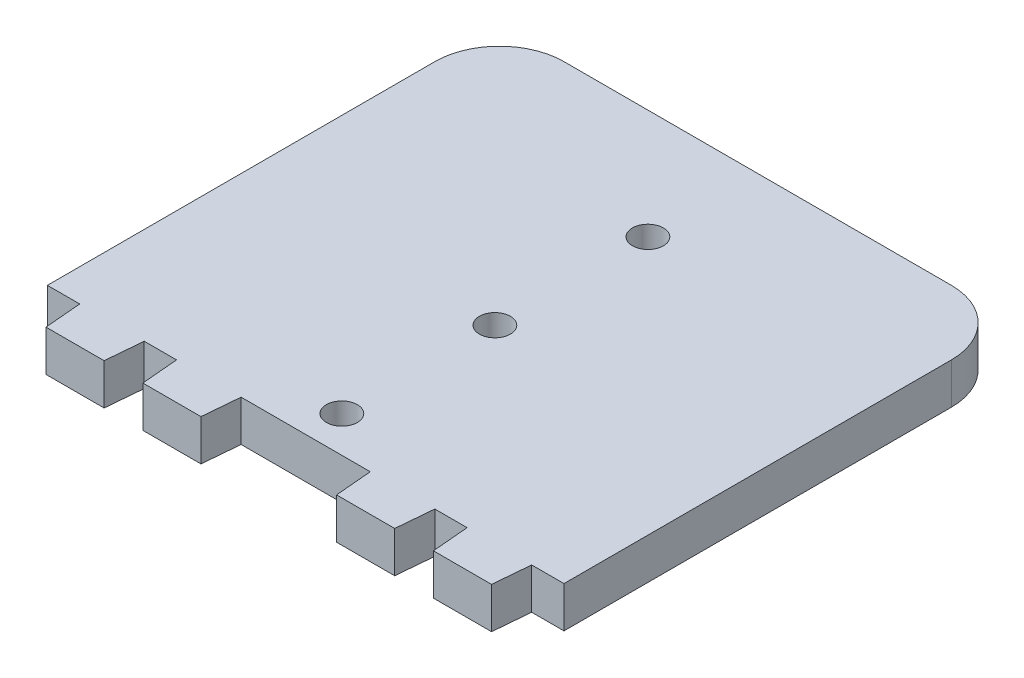
ISO-10303-21;
HEADER;
FILE_DESCRIPTION(('STEP AP214'),'2;1');
FILE_NAME('part.step','',(''),(''),'','','');
FILE_SCHEMA(('AUTOMOTIVE_DESIGN { 1 0 10303 214 1 1 1 1 }'));
ENDSEC;
DATA;
#1=APPLICATION_CONTEXT('core data for automotive mechanical design processes');
#2=APPLICATION_PROTOCOL_DEFINITION('international standard','automotive_design',2000,#1);
#3=PRODUCT_CONTEXT('',#1,'mechanical');
#4=PRODUCT('Part','Part','',(#3));
#5=PRODUCT_RELATED_PRODUCT_CATEGORY('part','',(#4));
#6=PRODUCT_DEFINITION_FORMATION('','',#4);
#7=PRODUCT_DEFINITION_CONTEXT('part definition',#1,'design');
#8=PRODUCT_DEFINITION('design','',#6,#7);
#9=PRODUCT_DEFINITION_SHAPE('','',#8);
#10=(LENGTH_UNIT() NAMED_UNIT(*) SI_UNIT(.MILLI.,.METRE.));
#11=(NAMED_UNIT(*) PLANE_ANGLE_UNIT() SI_UNIT($,.RADIAN.));
#12=(NAMED_UNIT(*) SI_UNIT($,.STERADIAN.) SOLID_ANGLE_UNIT());
#13=UNCERTAINTY_MEASURE_WITH_UNIT(LENGTH_MEASURE(1.E-05),#10,'distance_accuracy_value','');
#14=(GEOMETRIC_REPRESENTATION_CONTEXT(3) GLOBAL_UNCERTAINTY_ASSIGNED_CONTEXT((#13)) GLOBAL_UNIT_ASSIGNED_CONTEXT((#10,
#11,#12)) REPRESENTATION_CONTEXT('',''));
#15=CARTESIAN_POINT('',(0.,0.,0.));
#16=DIRECTION('',(0.,0.,1.));
#17=DIRECTION('',(1.,0.,0.));
#18=AXIS2_PLACEMENT_3D('',#15,#16,#17);
#19=CARTESIAN_POINT('',(22.8869329537262,6.35,2.00235633890864));
#20=DIRECTION('',(0.996194663464687,0.,0.0871561385358413));
#21=DIRECTION('',(0.0871561385358413,0.,-0.996194663464687));
#22=AXIS2_PLACEMENT_3D('',#19,#20,#21);
#23=PLANE('',#22);
#24=DIRECTION('',(-0.0871561385358414,0.,0.996194663464687));
#25=VECTOR('',#24,1.);
#26=CARTESIAN_POINT('',(22.8869329537262,0.,2.00235633890864));
#27=LINE('',#26,#25);
#28=CARTESIAN_POINT('',(20.,0.,35.));
#29=VERTEX_POINT('',#28);
#30=CARTESIAN_POINT('',(19.5,0.,40.715));
#31=VERTEX_POINT('',#30);
#32=EDGE_CURVE('E190',#29,#31,#27,.T.);
#33=ORIENTED_EDGE('',*,*,#32,.F.);
#34=DIRECTION('',(0.,-1.,0.));
#35=VECTOR('',#34,1.);
#36=CARTESIAN_POINT('',(20.,6.35,35.));
#37=LINE('',#36,#35);
#38=CARTESIAN_POINT('',(20.,6.35,35.));
#39=VERTEX_POINT('',#38);
#40=EDGE_CURVE('E184',#39,#29,#37,.T.);
#41=ORIENTED_EDGE('',*,*,#40,.F.);
#42=DIRECTION('',(-0.0871561385358414,0.,0.996194663464687));
#43=VECTOR('',#42,1.);
#44=CARTESIAN_POINT('',(22.8869329537262,6.35,2.00235633890864));
#45=LINE('',#44,#43);
#46=CARTESIAN_POINT('',(19.5,6.35,40.715));
#47=VERTEX_POINT('',#46);
#48=EDGE_CURVE('E187',#39,#47,#45,.T.);
#49=ORIENTED_EDGE('',*,*,#48,.T.);
#50=DIRECTION('',(0.,-1.,0.));
#51=VECTOR('',#50,1.);
#52=CARTESIAN_POINT('',(19.5,6.35,40.715));
#53=LINE('',#52,#51);
#54=EDGE_CURVE('E256',#47,#31,#53,.T.);
#55=ORIENTED_EDGE('',*,*,#54,.T.);
#56=EDGE_LOOP('',(#33,#41,#49,#55));
#57=FACE_BOUND('',#56,.T.);
#58=ADVANCED_FACE('F35',(#57),#23,.T.);
#59=CARTESIAN_POINT('',(0.,6.35,35.));
#60=DIRECTION('',(0.,0.,-1.));
#61=DIRECTION('',(-1.,0.,0.));
#62=AXIS2_PLACEMENT_3D('',#59,#60,#61);
#63=PLANE('',#62);
#64=DIRECTION('',(1.,0.,0.));
#65=VECTOR('',#64,1.);
#66=CARTESIAN_POINT('',(0.,0.,35.));
#67=LINE('',#66,#65);
#68=CARTESIAN_POINT('',(25.,0.,35.));
#69=VERTEX_POINT('',#68);
#70=EDGE_CURVE('E258',#29,#69,#67,.T.);
#71=ORIENTED_EDGE('',*,*,#70,.T.);
#72=DIRECTION('',(0.,-1.,0.));
#73=VECTOR('',#72,1.);
#74=CARTESIAN_POINT('',(25.,6.35,35.));
#75=LINE('',#74,#73);
#76=CARTESIAN_POINT('',(25.,6.35,35.));
#77=VERTEX_POINT('',#76);
#78=EDGE_CURVE('E194',#77,#69,#75,.T.);
#79=ORIENTED_EDGE('',*,*,#78,.F.);
#80=DIRECTION('',(1.,0.,0.));
#81=VECTOR('',#80,1.);
#82=CARTESIAN_POINT('',(0.,6.35,35.));
#83=LINE('',#82,#81);
#84=EDGE_CURVE('E197',#39,#77,#83,.T.);
#85=ORIENTED_EDGE('',*,*,#84,.F.);
#86=ORIENTED_EDGE('',*,*,#40,.T.);
#87=EDGE_LOOP('',(#71,#79,#85,#86));
#88=FACE_BOUND('',#87,.T.);
#89=ADVANCED_FACE('F198',(#88),#63,.F.);
#90=CARTESIAN_POINT('',(21.7712383844723,6.35,-1.90474526548309));
#91=DIRECTION('',(0.996194663464687,0.,-0.0871561385358411));
#92=DIRECTION('',(-0.0871561385358411,0.,-0.996194663464687));
#93=AXIS2_PLACEMENT_3D('',#90,#91,#92);
#94=PLANE('',#93);
#95=DIRECTION('',(0.0871561385358412,0.,0.996194663464687));
#96=VECTOR('',#95,1.);
#97=CARTESIAN_POINT('',(21.7712383844723,0.,-1.90474526548309));
#98=LINE('',#97,#96);
#99=CARTESIAN_POINT('',(25.5,0.,40.715));
#100=VERTEX_POINT('',#99);
#101=EDGE_CURVE('E260',#69,#100,#98,.T.);
#102=ORIENTED_EDGE('',*,*,#101,.T.);
#103=DIRECTION('',(0.,-1.,0.));
#104=VECTOR('',#103,1.);
#105=CARTESIAN_POINT('',(25.5,6.35,40.715));
#106=LINE('',#105,#104);
#107=CARTESIAN_POINT('',(25.5,6.35,40.715));
#108=VERTEX_POINT('',#107);
#109=EDGE_CURVE('E343',#108,#100,#106,.T.);
#110=ORIENTED_EDGE('',*,*,#109,.F.);
#111=DIRECTION('',(0.0871561385358412,0.,0.996194663464687));
#112=VECTOR('',#111,1.);
#113=CARTESIAN_POINT('',(21.7712383844723,6.35,-1.90474526548309));
#114=LINE('',#113,#112);
#115=EDGE_CURVE('E201',#77,#108,#114,.T.);
#116=ORIENTED_EDGE('',*,*,#115,.F.);
#117=ORIENTED_EDGE('',*,*,#78,.T.);
#118=EDGE_LOOP('',(#102,#110,#116,#117));
#119=FACE_BOUND('',#118,.T.);
#120=ADVANCED_FACE('F424',(#119),#94,.F.);
#121=CARTESIAN_POINT('',(0.,6.35,40.7150000000001));
#122=DIRECTION('',(0.,0.,1.));
#123=DIRECTION('',(1.,0.,0.));
#124=AXIS2_PLACEMENT_3D('',#121,#122,#123);
#125=PLANE('',#124);
#126=DIRECTION('',(-1.,0.,0.));
#127=VECTOR('',#126,1.);
#128=CARTESIAN_POINT('',(0.,0.,40.7150000000001));
#129=LINE('',#128,#127);
#130=CARTESIAN_POINT('',(34.5,0.,40.7150000000001));
#131=VERTEX_POINT('',#130);
#132=EDGE_CURVE('E265',#131,#100,#129,.T.);
#133=ORIENTED_EDGE('',*,*,#132,.F.);
#134=DIRECTION('',(0.,-1.,0.));
#135=VECTOR('',#134,1.);
#136=CARTESIAN_POINT('',(34.5,6.35,40.7150000000001));
#137=LINE('',#136,#135);
#138=CARTESIAN_POINT('',(34.5,6.35,40.7150000000001));
#139=VERTEX_POINT('',#138);
#140=EDGE_CURVE('E341',#139,#131,#137,.T.);
#141=ORIENTED_EDGE('',*,*,#140,.F.);
#142=DIRECTION('',(-1.,0.,0.));
#143=VECTOR('',#142,1.);
#144=CARTESIAN_POINT('',(0.,6.35,40.7150000000001));
#145=LINE('',#144,#143);
#146=EDGE_CURVE('E216',#139,#108,#145,.T.);
#147=ORIENTED_EDGE('',*,*,#146,.T.);
#148=ORIENTED_EDGE('',*,*,#109,.T.);
#149=EDGE_LOOP('',(#133,#141,#147,#148));
#150=FACE_BOUND('',#149,.T.);
#151=ADVANCED_FACE('F492',(#150),#125,.T.);
#152=CARTESIAN_POINT('',(37.772990066459,6.35,3.30472354037254));
#153=DIRECTION('',(0.996194663464687,0.,0.0871561385358411));
#154=DIRECTION('',(0.0871561385358411,0.,-0.996194663464687));
#155=AXIS2_PLACEMENT_3D('',#152,#153,#154);
#156=PLANE('',#155);
#157=DIRECTION('',(-0.0871561385358412,0.,0.996194663464687));
#158=VECTOR('',#157,1.);
#159=CARTESIAN_POINT('',(37.772990066459,0.,3.30472354037254));
#160=LINE('',#159,#158);
#161=CARTESIAN_POINT('',(35.,0.,35.));
#162=VERTEX_POINT('',#161);
#163=EDGE_CURVE('E268',#162,#131,#160,.T.);
#164=ORIENTED_EDGE('',*,*,#163,.F.);
#165=DIRECTION('',(0.,-1.,0.));
#166=VECTOR('',#165,1.);
#167=CARTESIAN_POINT('',(35.,6.35,35.));
#168=LINE('',#167,#166);
#169=CARTESIAN_POINT('',(35.,6.35,35.));
#170=VERTEX_POINT('',#169);
#171=EDGE_CURVE('E339',#170,#162,#168,.T.);
#172=ORIENTED_EDGE('',*,*,#171,.F.);
#173=DIRECTION('',(-0.0871561385358412,0.,0.996194663464687));
#174=VECTOR('',#173,1.);
#175=CARTESIAN_POINT('',(37.772990066459,6.35,3.30472354037254));
#176=LINE('',#175,#174);
#177=EDGE_CURVE('E219',#170,#139,#176,.T.);
#178=ORIENTED_EDGE('',*,*,#177,.T.);
#179=ORIENTED_EDGE('',*,*,#140,.T.);
#180=EDGE_LOOP('',(#164,#172,#178,#179));
#181=FACE_BOUND('',#180,.T.);
#182=ADVANCED_FACE('F490',(#181),#156,.T.);
#183=CARTESIAN_POINT('',(40.,0.,35.));
#184=VERTEX_POINT('',#183);
#185=EDGE_CURVE('E262',#162,#184,#67,.T.);
#186=ORIENTED_EDGE('',*,*,#185,.T.);
#187=DIRECTION('',(0.,-1.,0.));
#188=VECTOR('',#187,1.);
#189=CARTESIAN_POINT('',(40.,6.35,35.));
#190=LINE('',#189,#188);
#191=CARTESIAN_POINT('',(40.,6.35,35.));
#192=VERTEX_POINT('',#191);
#193=EDGE_CURVE('E336',#192,#184,#190,.T.);
#194=ORIENTED_EDGE('',*,*,#193,.F.);
#195=EDGE_CURVE('E204',#170,#192,#83,.T.);
#196=ORIENTED_EDGE('',*,*,#195,.F.);
#197=ORIENTED_EDGE('',*,*,#171,.T.);
#198=EDGE_LOOP('',(#186,#194,#196,#197));
#199=FACE_BOUND('',#198,.T.);
#200=ADVANCED_FACE('F384',(#199),#63,.F.);
#201=CARTESIAN_POINT('',(40.,6.35,0.));
#202=DIRECTION('',(1.,0.,0.));
#203=DIRECTION('',(0.,0.,-1.));
#204=AXIS2_PLACEMENT_3D('',#201,#202,#203);
#205=PLANE('',#204);
#206=DIRECTION('',(0.,0.,1.));
#207=VECTOR('',#206,1.);
#208=CARTESIAN_POINT('',(40.,0.,0.));
#209=LINE('',#208,#207);
#210=CARTESIAN_POINT('',(40.,0.,-25.));
#211=VERTEX_POINT('',#210);
#212=EDGE_CURVE('E271',#211,#184,#209,.T.);
#213=ORIENTED_EDGE('',*,*,#212,.F.);
#214=DIRECTION('',(0.,-1.,0.));
#215=VECTOR('',#214,1.);
#216=CARTESIAN_POINT('',(40.,6.35,-25.));
#217=LINE('',#216,#215);
#218=CARTESIAN_POINT('',(40.,6.35,-25.));
#219=VERTEX_POINT('',#218);
#220=EDGE_CURVE('E11',#211,#219,#217,.F.);
#221=ORIENTED_EDGE('',*,*,#220,.T.);
#222=DIRECTION('',(0.,0.,1.));
#223=VECTOR('',#222,1.);
#224=CARTESIAN_POINT('',(40.,6.35,0.));
#225=LINE('',#224,#223);
#226=EDGE_CURVE('E222',#219,#192,#225,.T.);
#227=ORIENTED_EDGE('',*,*,#226,.T.);
#228=ORIENTED_EDGE('',*,*,#193,.T.);
#229=EDGE_LOOP('',(#213,#221,#227,#228));
#230=FACE_BOUND('',#229,.T.);
#231=ADVANCED_FACE('F378',(#230),#205,.T.);
#232=CARTESIAN_POINT('',(0.,6.35,-35.));
#233=DIRECTION('',(0.,0.,-1.));
#234=DIRECTION('',(-1.,0.,0.));
#235=AXIS2_PLACEMENT_3D('',#232,#233,#234);
#236=PLANE('',#235);
#237=DIRECTION('',(1.,0.,0.));
#238=VECTOR('',#237,1.);
#239=CARTESIAN_POINT('',(0.,0.,-35.));
#240=LINE('',#239,#238);
#241=CARTESIAN_POINT('',(-30.,0.,-35.));
#242=VERTEX_POINT('',#241);
#243=CARTESIAN_POINT('',(30.,0.,-35.));
#244=VERTEX_POINT('',#243);
#245=EDGE_CURVE('E273',#242,#244,#240,.T.);
#246=ORIENTED_EDGE('',*,*,#245,.F.);
#247=DIRECTION('',(0.,-1.,0.));
#248=VECTOR('',#247,1.);
#249=CARTESIAN_POINT('',(-30.,6.35,-35.));
#250=LINE('',#249,#248);
#251=CARTESIAN_POINT('',(-30.,6.35,-35.));
#252=VERTEX_POINT('',#251);
#253=EDGE_CURVE('E355',#242,#252,#250,.F.);
#254=ORIENTED_EDGE('',*,*,#253,.T.);
#255=DIRECTION('',(1.,0.,0.));
#256=VECTOR('',#255,1.);
#257=CARTESIAN_POINT('',(0.,6.35,-35.));
#258=LINE('',#257,#256);
#259=CARTESIAN_POINT('',(30.,6.35,-35.));
#260=VERTEX_POINT('',#259);
#261=EDGE_CURVE('E224',#252,#260,#258,.T.);
#262=ORIENTED_EDGE('',*,*,#261,.T.);
#263=DIRECTION('',(0.,-1.,0.));
#264=VECTOR('',#263,1.);
#265=CARTESIAN_POINT('',(30.,6.35,-35.));
#266=LINE('',#265,#264);
#267=EDGE_CURVE('E352',#260,#244,#266,.T.);
#268=ORIENTED_EDGE('',*,*,#267,.T.);
#269=EDGE_LOOP('',(#246,#254,#262,#268));
#270=FACE_BOUND('',#269,.T.);
#271=ADVANCED_FACE('F374',(#270),#236,.T.);
#272=CARTESIAN_POINT('',(-40.,6.35,0.));
#273=DIRECTION('',(1.,0.,0.));
#274=DIRECTION('',(0.,0.,-1.));
#275=AXIS2_PLACEMENT_3D('',#272,#273,#274);
#276=PLANE('',#275);
#277=DIRECTION('',(0.,0.,1.));
#278=VECTOR('',#277,1.);
#279=CARTESIAN_POINT('',(-40.,6.35,0.));
#280=LINE('',#279,#278);
#281=CARTESIAN_POINT('',(-40.,6.35,-25.));
#282=VERTEX_POINT('',#281);
#283=CARTESIAN_POINT('',(-40.,6.35,35.));
#284=VERTEX_POINT('',#283);
#285=EDGE_CURVE('E226',#282,#284,#280,.T.);
#286=ORIENTED_EDGE('',*,*,#285,.F.);
#287=DIRECTION('',(0.,-1.,0.));
#288=VECTOR('',#287,1.);
#289=CARTESIAN_POINT('',(-40.,0.,-25.));
#290=LINE('',#289,#288);
#291=CARTESIAN_POINT('',(-40.,0.,-25.));
#292=VERTEX_POINT('',#291);
#293=EDGE_CURVE('E193',#282,#292,#290,.T.);
#294=ORIENTED_EDGE('',*,*,#293,.T.);
#295=DIRECTION('',(0.,0.,1.));
#296=VECTOR('',#295,1.);
#297=CARTESIAN_POINT('',(-40.,0.,0.));
#298=LINE('',#297,#296);
#299=CARTESIAN_POINT('',(-40.,0.,35.));
#300=VERTEX_POINT('',#299);
#301=EDGE_CURVE('E276',#292,#300,#298,.T.);
#302=ORIENTED_EDGE('',*,*,#301,.T.);
#303=DIRECTION('',(0.,-1.,0.));
#304=VECTOR('',#303,1.);
#305=CARTESIAN_POINT('',(-40.,6.35,35.));
#306=LINE('',#305,#304);
#307=EDGE_CURVE('E333',#284,#300,#306,.T.);
#308=ORIENTED_EDGE('',*,*,#307,.F.);
#309=EDGE_LOOP('',(#286,#294,#302,#308));
#310=FACE_BOUND('',#309,.T.);
#311=ADVANCED_FACE('F364',(#310),#276,.F.);
#312=CARTESIAN_POINT('',(-35.,0.,35.));
#313=VERTEX_POINT('',#312);
#314=EDGE_CURVE('E278',#300,#313,#67,.T.);
#315=ORIENTED_EDGE('',*,*,#314,.T.);
#316=DIRECTION('',(0.,-1.,0.));
#317=VECTOR('',#316,1.);
#318=CARTESIAN_POINT('',(-35.,6.35,35.));
#319=LINE('',#318,#317);
#320=CARTESIAN_POINT('',(-35.,6.35,35.));
#321=VERTEX_POINT('',#320);
#322=EDGE_CURVE('E330',#321,#313,#319,.T.);
#323=ORIENTED_EDGE('',*,*,#322,.F.);
#324=EDGE_CURVE('E228',#284,#321,#83,.T.);
#325=ORIENTED_EDGE('',*,*,#324,.F.);
#326=ORIENTED_EDGE('',*,*,#307,.T.);
#327=EDGE_LOOP('',(#315,#323,#325,#326));
#328=FACE_BOUND('',#327,.T.);
#329=ADVANCED_FACE('F482',(#328),#63,.F.);
#330=CARTESIAN_POINT('',(-37.772990066459,6.35,3.30472354037254));
#331=DIRECTION('',(0.996194663464687,0.,-0.0871561385358411));
#332=DIRECTION('',(-0.0871561385358411,0.,-0.996194663464687));
#333=AXIS2_PLACEMENT_3D('',#330,#331,#332);
#334=PLANE('',#333);
#335=DIRECTION('',(0.0871561385358412,0.,0.996194663464687));
#336=VECTOR('',#335,1.);
#337=CARTESIAN_POINT('',(-37.772990066459,0.,3.30472354037254));
#338=LINE('',#337,#336);
#339=CARTESIAN_POINT('',(-34.5,0.,40.7150000000001));
#340=VERTEX_POINT('',#339);
#341=EDGE_CURVE('E279',#313,#340,#338,.T.);
#342=ORIENTED_EDGE('',*,*,#341,.T.);
#343=DIRECTION('',(0.,-1.,0.));
#344=VECTOR('',#343,1.);
#345=CARTESIAN_POINT('',(-34.5,6.35,40.7150000000001));
#346=LINE('',#345,#344);
#347=CARTESIAN_POINT('',(-34.5,6.35,40.7150000000001));
#348=VERTEX_POINT('',#347);
#349=EDGE_CURVE('E327',#348,#340,#346,.T.);
#350=ORIENTED_EDGE('',*,*,#349,.F.);
#351=DIRECTION('',(0.0871561385358412,0.,0.996194663464687));
#352=VECTOR('',#351,1.);
#353=CARTESIAN_POINT('',(-37.772990066459,6.35,3.30472354037254));
#354=LINE('',#353,#352);
#355=EDGE_CURVE('E229',#321,#348,#354,.T.);
#356=ORIENTED_EDGE('',*,*,#355,.F.);
#357=ORIENTED_EDGE('',*,*,#322,.T.);
#358=EDGE_LOOP('',(#342,#350,#356,#357));
#359=FACE_BOUND('',#358,.T.);
#360=ADVANCED_FACE('F478',(#359),#334,.F.);
#361=CARTESIAN_POINT('',(0.,6.35,40.7150000000001));
#362=DIRECTION('',(0.,0.,-1.));
#363=DIRECTION('',(-1.,0.,0.));
#364=AXIS2_PLACEMENT_3D('',#361,#362,#363);
#365=PLANE('',#364);
#366=DIRECTION('',(1.,0.,0.));
#367=VECTOR('',#366,1.);
#368=CARTESIAN_POINT('',(0.,0.,40.7150000000001));
#369=LINE('',#368,#367);
#370=CARTESIAN_POINT('',(-25.5,0.,40.7150000000001));
#371=VERTEX_POINT('',#370);
#372=EDGE_CURVE('E281',#340,#371,#369,.T.);
#373=ORIENTED_EDGE('',*,*,#372,.T.);
#374=DIRECTION('',(0.,-1.,0.));
#375=VECTOR('',#374,1.);
#376=CARTESIAN_POINT('',(-25.5,6.35,40.7150000000001));
#377=LINE('',#376,#375);
#378=CARTESIAN_POINT('',(-25.5,6.35,40.7150000000001));
#379=VERTEX_POINT('',#378);
#380=EDGE_CURVE('E325',#379,#371,#377,.T.);
#381=ORIENTED_EDGE('',*,*,#380,.F.);
#382=DIRECTION('',(1.,0.,0.));
#383=VECTOR('',#382,1.);
#384=CARTESIAN_POINT('',(0.,6.35,40.7150000000001));
#385=LINE('',#384,#383);
#386=EDGE_CURVE('E231',#348,#379,#385,.T.);
#387=ORIENTED_EDGE('',*,*,#386,.F.);
#388=ORIENTED_EDGE('',*,*,#349,.T.);
#389=EDGE_LOOP('',(#373,#381,#387,#388));
#390=FACE_BOUND('',#389,.T.);
#391=ADVANCED_FACE('F474',(#390),#365,.F.);
#392=CARTESIAN_POINT('',(-21.7712383844723,6.35,-1.90474526548309));
#393=DIRECTION('',(0.996194663464687,0.,0.0871561385358411));
#394=DIRECTION('',(0.0871561385358411,0.,-0.996194663464687));
#395=AXIS2_PLACEMENT_3D('',#392,#393,#394);
#396=PLANE('',#395);
#397=DIRECTION('',(-0.0871561385358412,0.,0.996194663464687));
#398=VECTOR('',#397,1.);
#399=CARTESIAN_POINT('',(-21.7712383844723,0.,-1.90474526548309));
#400=LINE('',#399,#398);
#401=CARTESIAN_POINT('',(-25.,0.,35.));
#402=VERTEX_POINT('',#401);
#403=EDGE_CURVE('E284',#402,#371,#400,.T.);
#404=ORIENTED_EDGE('',*,*,#403,.F.);
#405=DIRECTION('',(0.,-1.,0.));
#406=VECTOR('',#405,1.);
#407=CARTESIAN_POINT('',(-25.,6.35,35.));
#408=LINE('',#407,#406);
#409=CARTESIAN_POINT('',(-25.,6.35,35.));
#410=VERTEX_POINT('',#409);
#411=EDGE_CURVE('E323',#410,#402,#408,.T.);
#412=ORIENTED_EDGE('',*,*,#411,.F.);
#413=DIRECTION('',(-0.0871561385358412,0.,0.996194663464687));
#414=VECTOR('',#413,1.);
#415=CARTESIAN_POINT('',(-21.7712383844723,6.35,-1.90474526548309));
#416=LINE('',#415,#414);
#417=EDGE_CURVE('E233',#410,#379,#416,.T.);
#418=ORIENTED_EDGE('',*,*,#417,.T.);
#419=ORIENTED_EDGE('',*,*,#380,.T.);
#420=EDGE_LOOP('',(#404,#412,#418,#419));
#421=FACE_BOUND('',#420,.T.);
#422=ADVANCED_FACE('F471',(#421),#396,.T.);
#423=CARTESIAN_POINT('',(-20.,0.,35.));
#424=VERTEX_POINT('',#423);
#425=EDGE_CURVE('E287',#402,#424,#67,.T.);
#426=ORIENTED_EDGE('',*,*,#425,.T.);
#427=DIRECTION('',(0.,-1.,0.));
#428=VECTOR('',#427,1.);
#429=CARTESIAN_POINT('',(-20.,6.35,35.));
#430=LINE('',#429,#428);
#431=CARTESIAN_POINT('',(-20.,6.35,35.));
#432=VERTEX_POINT('',#431);
#433=EDGE_CURVE('E320',#432,#424,#430,.T.);
#434=ORIENTED_EDGE('',*,*,#433,.F.);
#435=EDGE_CURVE('E236',#410,#432,#83,.T.);
#436=ORIENTED_EDGE('',*,*,#435,.F.);
#437=ORIENTED_EDGE('',*,*,#411,.T.);
#438=EDGE_LOOP('',(#426,#434,#436,#437));
#439=FACE_BOUND('',#438,.T.);
#440=ADVANCED_FACE('F458',(#439),#63,.F.);
#441=CARTESIAN_POINT('',(-22.8869329537262,6.35,2.00235633890865));
#442=DIRECTION('',(0.996194663464687,0.,-0.0871561385358418));
#443=DIRECTION('',(-0.0871561385358418,0.,-0.996194663464687));
#444=AXIS2_PLACEMENT_3D('',#441,#442,#443);
#445=PLANE('',#444);
#446=DIRECTION('',(0.0871561385358418,0.,0.996194663464687));
#447=VECTOR('',#446,1.);
#448=CARTESIAN_POINT('',(-22.8869329537262,0.,2.00235633890865));
#449=LINE('',#448,#447);
#450=CARTESIAN_POINT('',(-19.5,0.,40.715));
#451=VERTEX_POINT('',#450);
#452=EDGE_CURVE('E288',#424,#451,#449,.T.);
#453=ORIENTED_EDGE('',*,*,#452,.T.);
#454=DIRECTION('',(0.,-1.,0.));
#455=VECTOR('',#454,1.);
#456=CARTESIAN_POINT('',(-19.5,6.35,40.715));
#457=LINE('',#456,#455);
#458=CARTESIAN_POINT('',(-19.5,6.35,40.715));
#459=VERTEX_POINT('',#458);
#460=EDGE_CURVE('E317',#459,#451,#457,.T.);
#461=ORIENTED_EDGE('',*,*,#460,.F.);
#462=DIRECTION('',(0.0871561385358418,0.,0.996194663464687));
#463=VECTOR('',#462,1.);
#464=CARTESIAN_POINT('',(-22.8869329537262,6.35,2.00235633890865));
#465=LINE('',#464,#463);
#466=EDGE_CURVE('E237',#432,#459,#465,.T.);
#467=ORIENTED_EDGE('',*,*,#466,.F.);
#468=ORIENTED_EDGE('',*,*,#433,.T.);
#469=EDGE_LOOP('',(#453,#461,#467,#468));
#470=FACE_BOUND('',#469,.T.);
#471=ADVANCED_FACE('F466',(#470),#445,.F.);
#472=CARTESIAN_POINT('',(0.,6.35,40.715));
#473=DIRECTION('',(0.,0.,-1.));
#474=DIRECTION('',(-1.,0.,0.));
#475=AXIS2_PLACEMENT_3D('',#472,#473,#474);
#476=PLANE('',#475);
#477=DIRECTION('',(1.,0.,0.));
#478=VECTOR('',#477,1.);
#479=CARTESIAN_POINT('',(0.,0.,40.715));
#480=LINE('',#479,#478);
#481=CARTESIAN_POINT('',(-10.5,0.,40.715));
#482=VERTEX_POINT('',#481);
#483=EDGE_CURVE('E290',#451,#482,#480,.T.);
#484=ORIENTED_EDGE('',*,*,#483,.T.);
#485=DIRECTION('',(0.,-1.,0.));
#486=VECTOR('',#485,1.);
#487=CARTESIAN_POINT('',(-10.5,6.35,40.715));
#488=LINE('',#487,#486);
#489=CARTESIAN_POINT('',(-10.5,6.35,40.715));
#490=VERTEX_POINT('',#489);
#491=EDGE_CURVE('E315',#490,#482,#488,.T.);
#492=ORIENTED_EDGE('',*,*,#491,.F.);
#493=DIRECTION('',(1.,0.,0.));
#494=VECTOR('',#493,1.);
#495=CARTESIAN_POINT('',(0.,6.35,40.715));
#496=LINE('',#495,#494);
#497=EDGE_CURVE('E239',#459,#490,#496,.T.);
#498=ORIENTED_EDGE('',*,*,#497,.F.);
#499=ORIENTED_EDGE('',*,*,#460,.T.);
#500=EDGE_LOOP('',(#484,#492,#498,#499));
#501=FACE_BOUND('',#500,.T.);
#502=ADVANCED_FACE('F462',(#501),#476,.F.);
#503=CARTESIAN_POINT('',(-6.88518127173936,6.35,-0.602378064019191));
#504=DIRECTION('',(0.996194663464687,0.,0.087156138535843));
#505=DIRECTION('',(0.087156138535843,0.,-0.996194663464687));
#506=AXIS2_PLACEMENT_3D('',#503,#504,#505);
#507=PLANE('',#506);
#508=DIRECTION('',(-0.087156138535843,0.,0.996194663464687));
#509=VECTOR('',#508,1.);
#510=CARTESIAN_POINT('',(-6.88518127173936,0.,-0.602378064019191));
#511=LINE('',#510,#509);
#512=CARTESIAN_POINT('',(-10.,0.,35.));
#513=VERTEX_POINT('',#512);
#514=EDGE_CURVE('E293',#513,#482,#511,.T.);
#515=ORIENTED_EDGE('',*,*,#514,.F.);
#516=DIRECTION('',(0.,-1.,0.));
#517=VECTOR('',#516,1.);
#518=CARTESIAN_POINT('',(-10.,6.35,35.));
#519=LINE('',#518,#517);
#520=CARTESIAN_POINT('',(-10.,6.35,35.));
#521=VERTEX_POINT('',#520);
#522=EDGE_CURVE('E313',#521,#513,#519,.T.);
#523=ORIENTED_EDGE('',*,*,#522,.F.);
#524=DIRECTION('',(-0.087156138535843,0.,0.996194663464687));
#525=VECTOR('',#524,1.);
#526=CARTESIAN_POINT('',(-6.88518127173936,6.35,-0.602378064019191));
#527=LINE('',#526,#525);
#528=EDGE_CURVE('E241',#521,#490,#527,.T.);
#529=ORIENTED_EDGE('',*,*,#528,.T.);
#530=ORIENTED_EDGE('',*,*,#491,.T.);
#531=EDGE_LOOP('',(#515,#523,#529,#530));
#532=FACE_BOUND('',#531,.T.);
#533=ADVANCED_FACE('F457',(#532),#507,.T.);
#534=CARTESIAN_POINT('',(10.,0.,35.));
#535=VERTEX_POINT('',#534);
#536=EDGE_CURVE('E261',#513,#535,#67,.T.);
#537=ORIENTED_EDGE('',*,*,#536,.T.);
#538=DIRECTION('',(0.,-1.,0.));
#539=VECTOR('',#538,1.);
#540=CARTESIAN_POINT('',(10.,6.35,35.));
#541=LINE('',#540,#539);
#542=CARTESIAN_POINT('',(10.,6.35,35.));
#543=VERTEX_POINT('',#542);
#544=EDGE_CURVE('E310',#543,#535,#541,.T.);
#545=ORIENTED_EDGE('',*,*,#544,.F.);
#546=EDGE_CURVE('E203',#521,#543,#83,.T.);
#547=ORIENTED_EDGE('',*,*,#546,.F.);
#548=ORIENTED_EDGE('',*,*,#522,.T.);
#549=EDGE_LOOP('',(#537,#545,#547,#548));
#550=FACE_BOUND('',#549,.T.);
#551=ADVANCED_FACE('F394',(#550),#63,.F.);
#552=CARTESIAN_POINT('',(6.88518127173929,6.35,-0.602378064019197));
#553=DIRECTION('',(0.996194663464687,0.,-0.0871561385358448));
#554=DIRECTION('',(-0.0871561385358448,0.,-0.996194663464687));
#555=AXIS2_PLACEMENT_3D('',#552,#553,#554);
#556=PLANE('',#555);
#557=DIRECTION('',(0.0871561385358448,0.,0.996194663464687));
#558=VECTOR('',#557,1.);
#559=CARTESIAN_POINT('',(6.88518127173929,0.,-0.602378064019197));
#560=LINE('',#559,#558);
#561=CARTESIAN_POINT('',(10.5,0.,40.715));
#562=VERTEX_POINT('',#561);
#563=EDGE_CURVE('E296',#535,#562,#560,.T.);
#564=ORIENTED_EDGE('',*,*,#563,.T.);
#565=DIRECTION('',(0.,-1.,0.));
#566=VECTOR('',#565,1.);
#567=CARTESIAN_POINT('',(10.5,6.35,40.715));
#568=LINE('',#567,#566);
#569=CARTESIAN_POINT('',(10.5,6.35,40.715));
#570=VERTEX_POINT('',#569);
#571=EDGE_CURVE('E308',#570,#562,#568,.T.);
#572=ORIENTED_EDGE('',*,*,#571,.F.);
#573=DIRECTION('',(0.0871561385358448,0.,0.996194663464687));
#574=VECTOR('',#573,1.);
#575=CARTESIAN_POINT('',(6.88518127173929,6.35,-0.602378064019197));
#576=LINE('',#575,#574);
#577=EDGE_CURVE('E244',#543,#570,#576,.T.);
#578=ORIENTED_EDGE('',*,*,#577,.F.);
#579=ORIENTED_EDGE('',*,*,#544,.T.);
#580=EDGE_LOOP('',(#564,#572,#578,#579));
#581=FACE_BOUND('',#580,.T.);
#582=ADVANCED_FACE('F400',(#581),#556,.F.);
#583=CARTESIAN_POINT('',(0.,6.35,5.70000000000001));
#584=DIRECTION('',(0.,-1.,0.));
#585=DIRECTION('',(0.,0.,-1.));
#586=AXIS2_PLACEMENT_3D('',#583,#584,#585);
#587=CYLINDRICAL_SURFACE('',#586,2.4);
#588=CARTESIAN_POINT('',(0.,6.35,5.70000000000001));
#589=DIRECTION('',(0.,1.,0.));
#590=DIRECTION('',(0.,0.,1.));
#591=AXIS2_PLACEMENT_3D('',#588,#589,#590);
#592=CIRCLE('',#591,2.4);
#593=CARTESIAN_POINT('',(0.,6.35,8.10000000000001));
#594=VERTEX_POINT('',#593);
#595=EDGE_CURVE('E250',#594,#594,#592,.T.);
#596=ORIENTED_EDGE('',*,*,#595,.T.);
#597=EDGE_LOOP('',(#596));
#598=FACE_BOUND('',#597,.T.);
#599=CARTESIAN_POINT('',(0.,0.,5.70000000000001));
#600=DIRECTION('',(0.,1.,0.));
#601=DIRECTION('',(0.,0.,1.));
#602=AXIS2_PLACEMENT_3D('',#599,#600,#601);
#603=CIRCLE('',#602,2.4);
#604=CARTESIAN_POINT('',(0.,0.,8.10000000000001));
#605=VERTEX_POINT('',#604);
#606=EDGE_CURVE('E212',#605,#605,#603,.T.);
#607=ORIENTED_EDGE('',*,*,#606,.F.);
#608=EDGE_LOOP('',(#607));
#609=FACE_BOUND('',#608,.T.);
#610=ADVANCED_FACE('F415',(#598,#609),#587,.F.);
#611=CARTESIAN_POINT('',(0.,6.35,29.4));
#612=DIRECTION('',(0.,-1.,0.));
#613=DIRECTION('',(0.,0.,-1.));
#614=AXIS2_PLACEMENT_3D('',#611,#612,#613);
#615=CYLINDRICAL_SURFACE('',#614,2.4);
#616=CARTESIAN_POINT('',(0.,6.35,29.4));
#617=DIRECTION('',(0.,1.,0.));
#618=DIRECTION('',(0.,0.,1.));
#619=AXIS2_PLACEMENT_3D('',#616,#617,#618);
#620=CIRCLE('',#619,2.4);
#621=CARTESIAN_POINT('',(0.,6.35,31.8));
#622=VERTEX_POINT('',#621);
#623=EDGE_CURVE('E247',#622,#622,#620,.T.);
#624=ORIENTED_EDGE('',*,*,#623,.T.);
#625=EDGE_LOOP('',(#624));
#626=FACE_BOUND('',#625,.T.);
#627=CARTESIAN_POINT('',(0.,0.,29.4));
#628=DIRECTION('',(0.,1.,0.));
#629=DIRECTION('',(0.,0.,1.));
#630=AXIS2_PLACEMENT_3D('',#627,#628,#629);
#631=CIRCLE('',#630,2.4);
#632=CARTESIAN_POINT('',(0.,0.,31.8));
#633=VERTEX_POINT('',#632);
#634=EDGE_CURVE('E302',#633,#633,#631,.T.);
#635=ORIENTED_EDGE('',*,*,#634,.F.);
#636=EDGE_LOOP('',(#635));
#637=FACE_BOUND('',#636,.T.);
#638=ADVANCED_FACE('F407',(#626,#637),#615,.F.);
#639=CARTESIAN_POINT('',(0.,6.35,40.715));
#640=DIRECTION('',(0.,0.,1.));
#641=DIRECTION('',(1.,0.,0.));
#642=AXIS2_PLACEMENT_3D('',#639,#640,#641);
#643=PLANE('',#642);
#644=DIRECTION('',(-1.,0.,0.));
#645=VECTOR('',#644,1.);
#646=CARTESIAN_POINT('',(0.,0.,40.715));
#647=LINE('',#646,#645);
#648=EDGE_CURVE('E299',#31,#562,#647,.T.);
#649=ORIENTED_EDGE('',*,*,#648,.F.);
#650=ORIENTED_EDGE('',*,*,#54,.F.);
#651=DIRECTION('',(-1.,0.,0.));
#652=VECTOR('',#651,1.);
#653=CARTESIAN_POINT('',(0.,6.35,40.715));
#654=LINE('',#653,#652);
#655=EDGE_CURVE('E208',#47,#570,#654,.T.);
#656=ORIENTED_EDGE('',*,*,#655,.T.);
#657=ORIENTED_EDGE('',*,*,#571,.T.);
#658=EDGE_LOOP('',(#649,#650,#656,#657));
#659=FACE_BOUND('',#658,.T.);
#660=ADVANCED_FACE('F404',(#659),#643,.T.);
#661=CARTESIAN_POINT('',(0.,6.35,-18.));
#662=DIRECTION('',(0.,-1.,0.));
#663=DIRECTION('',(0.,0.,-1.));
#664=AXIS2_PLACEMENT_3D('',#661,#662,#663);
#665=CYLINDRICAL_SURFACE('',#664,2.4);
#666=CARTESIAN_POINT('',(0.,6.35,-18.));
#667=DIRECTION('',(0.,1.,0.));
#668=DIRECTION('',(0.,0.,1.));
#669=AXIS2_PLACEMENT_3D('',#666,#667,#668);
#670=CIRCLE('',#669,2.4);
#671=CARTESIAN_POINT('',(0.,6.35,-15.6));
#672=VERTEX_POINT('',#671);
#673=EDGE_CURVE('E253',#672,#672,#670,.T.);
#674=ORIENTED_EDGE('',*,*,#673,.T.);
#675=EDGE_LOOP('',(#674));
#676=FACE_BOUND('',#675,.T.);
#677=CARTESIAN_POINT('',(0.,0.,-18.));
#678=DIRECTION('',(0.,1.,0.));
#679=DIRECTION('',(0.,0.,1.));
#680=AXIS2_PLACEMENT_3D('',#677,#678,#679);
#681=CIRCLE('',#680,2.4);
#682=CARTESIAN_POINT('',(0.,0.,-15.6));
#683=VERTEX_POINT('',#682);
#684=EDGE_CURVE('E209',#683,#683,#681,.T.);
#685=ORIENTED_EDGE('',*,*,#684,.F.);
#686=EDGE_LOOP('',(#685));
#687=FACE_BOUND('',#686,.T.);
#688=ADVANCED_FACE('F406',(#676,#687),#665,.F.);
#689=CARTESIAN_POINT('',(0.,6.35,0.));
#690=DIRECTION('',(0.,1.,0.));
#691=DIRECTION('',(0.,0.,1.));
#692=AXIS2_PLACEMENT_3D('',#689,#690,#691);
#693=PLANE('',#692);
#694=ORIENTED_EDGE('',*,*,#261,.F.);
#695=CARTESIAN_POINT('',(-30.,6.35,-25.));
#696=DIRECTION('',(0.,1.,0.));
#697=DIRECTION('',(0.,0.,1.));
#698=AXIS2_PLACEMENT_3D('',#695,#696,#697);
#699=CIRCLE('',#698,10.);
#700=EDGE_CURVE('E43',#252,#282,#699,.T.);
#701=ORIENTED_EDGE('',*,*,#700,.T.);
#702=ORIENTED_EDGE('',*,*,#285,.T.);
#703=ORIENTED_EDGE('',*,*,#324,.T.);
#704=ORIENTED_EDGE('',*,*,#355,.T.);
#705=ORIENTED_EDGE('',*,*,#386,.T.);
#706=ORIENTED_EDGE('',*,*,#417,.F.);
#707=ORIENTED_EDGE('',*,*,#435,.T.);
#708=ORIENTED_EDGE('',*,*,#466,.T.);
#709=ORIENTED_EDGE('',*,*,#497,.T.);
#710=ORIENTED_EDGE('',*,*,#528,.F.);
#711=ORIENTED_EDGE('',*,*,#546,.T.);
#712=ORIENTED_EDGE('',*,*,#577,.T.);
#713=ORIENTED_EDGE('',*,*,#655,.F.);
#714=ORIENTED_EDGE('',*,*,#48,.F.);
#715=ORIENTED_EDGE('',*,*,#84,.T.);
#716=ORIENTED_EDGE('',*,*,#115,.T.);
#717=ORIENTED_EDGE('',*,*,#146,.F.);
#718=ORIENTED_EDGE('',*,*,#177,.F.);
#719=ORIENTED_EDGE('',*,*,#195,.T.);
#720=ORIENTED_EDGE('',*,*,#226,.F.);
#721=CARTESIAN_POINT('',(30.,6.35,-25.));
#722=DIRECTION('',(0.,1.,0.));
#723=DIRECTION('',(0.,0.,1.));
#724=AXIS2_PLACEMENT_3D('',#721,#722,#723);
#725=CIRCLE('',#724,10.);
#726=EDGE_CURVE('E55',#219,#260,#725,.T.);
#727=ORIENTED_EDGE('',*,*,#726,.T.);
#728=EDGE_LOOP('',(#694,#701,#702,#703,#704,#705,#706,#707,#708,#709,#710,#711,#712,#713,#714,
#715,#716,#717,#718,#719,#720,#727));
#729=FACE_BOUND('',#728,.T.);
#730=ORIENTED_EDGE('',*,*,#623,.F.);
#731=EDGE_LOOP('',(#730));
#732=FACE_BOUND('',#731,.T.);
#733=ORIENTED_EDGE('',*,*,#595,.F.);
#734=EDGE_LOOP('',(#733));
#735=FACE_BOUND('',#734,.T.);
#736=ORIENTED_EDGE('',*,*,#673,.F.);
#737=EDGE_LOOP('',(#736));
#738=FACE_BOUND('',#737,.T.);
#739=ADVANCED_FACE('F205',(#729,#732,#735,#738),#693,.T.);
#740=CARTESIAN_POINT('',(0.,0.,0.));
#741=DIRECTION('',(0.,1.,0.));
#742=DIRECTION('',(0.,0.,1.));
#743=AXIS2_PLACEMENT_3D('',#740,#741,#742);
#744=PLANE('',#743);
#745=ORIENTED_EDGE('',*,*,#301,.F.);
#746=CARTESIAN_POINT('',(-30.,0.,-25.));
#747=DIRECTION('',(0.,1.,0.));
#748=DIRECTION('',(0.,0.,1.));
#749=AXIS2_PLACEMENT_3D('',#746,#747,#748);
#750=CIRCLE('',#749,10.);
#751=EDGE_CURVE('E350',#292,#242,#750,.F.);
#752=ORIENTED_EDGE('',*,*,#751,.T.);
#753=ORIENTED_EDGE('',*,*,#245,.T.);
#754=CARTESIAN_POINT('',(30.,0.,-25.));
#755=DIRECTION('',(0.,1.,0.));
#756=DIRECTION('',(0.,0.,1.));
#757=AXIS2_PLACEMENT_3D('',#754,#755,#756);
#758=CIRCLE('',#757,10.);
#759=EDGE_CURVE('E348',#244,#211,#758,.F.);
#760=ORIENTED_EDGE('',*,*,#759,.T.);
#761=ORIENTED_EDGE('',*,*,#212,.T.);
#762=ORIENTED_EDGE('',*,*,#185,.F.);
#763=ORIENTED_EDGE('',*,*,#163,.T.);
#764=ORIENTED_EDGE('',*,*,#132,.T.);
#765=ORIENTED_EDGE('',*,*,#101,.F.);
#766=ORIENTED_EDGE('',*,*,#70,.F.);
#767=ORIENTED_EDGE('',*,*,#32,.T.);
#768=ORIENTED_EDGE('',*,*,#648,.T.);
#769=ORIENTED_EDGE('',*,*,#563,.F.);
#770=ORIENTED_EDGE('',*,*,#536,.F.);
#771=ORIENTED_EDGE('',*,*,#514,.T.);
#772=ORIENTED_EDGE('',*,*,#483,.F.);
#773=ORIENTED_EDGE('',*,*,#452,.F.);
#774=ORIENTED_EDGE('',*,*,#425,.F.);
#775=ORIENTED_EDGE('',*,*,#403,.T.);
#776=ORIENTED_EDGE('',*,*,#372,.F.);
#777=ORIENTED_EDGE('',*,*,#341,.F.);
#778=ORIENTED_EDGE('',*,*,#314,.F.);
#779=EDGE_LOOP('',(#745,#752,#753,#760,#761,#762,#763,#764,#765,#766,#767,#768,#769,#770,#771,
#772,#773,#774,#775,#776,#777,#778));
#780=FACE_BOUND('',#779,.T.);
#781=ORIENTED_EDGE('',*,*,#634,.T.);
#782=EDGE_LOOP('',(#781));
#783=FACE_BOUND('',#782,.T.);
#784=ORIENTED_EDGE('',*,*,#606,.T.);
#785=EDGE_LOOP('',(#784));
#786=FACE_BOUND('',#785,.T.);
#787=ORIENTED_EDGE('',*,*,#684,.T.);
#788=EDGE_LOOP('',(#787));
#789=FACE_BOUND('',#788,.T.);
#790=ADVANCED_FACE('F370',(#780,#783,#786,#789),#744,.F.);
#791=CARTESIAN_POINT('',(-30.,6.35,-25.));
#792=DIRECTION('',(0.,1.,0.));
#793=DIRECTION('',(0.,0.,1.));
#794=AXIS2_PLACEMENT_3D('',#791,#792,#793);
#795=CYLINDRICAL_SURFACE('',#794,10.);
#796=ORIENTED_EDGE('',*,*,#700,.F.);
#797=ORIENTED_EDGE('',*,*,#253,.F.);
#798=ORIENTED_EDGE('',*,*,#751,.F.);
#799=ORIENTED_EDGE('',*,*,#293,.F.);
#800=EDGE_LOOP('',(#796,#797,#798,#799));
#801=FACE_BOUND('',#800,.T.);
#802=ADVANCED_FACE('F367',(#801),#795,.T.);
#803=CARTESIAN_POINT('',(30.,6.35,-25.));
#804=DIRECTION('',(0.,-1.,0.));
#805=DIRECTION('',(0.,0.,-1.));
#806=AXIS2_PLACEMENT_3D('',#803,#804,#805);
#807=CYLINDRICAL_SURFACE('',#806,10.);
#808=ORIENTED_EDGE('',*,*,#726,.F.);
#809=ORIENTED_EDGE('',*,*,#220,.F.);
#810=ORIENTED_EDGE('',*,*,#759,.F.);
#811=ORIENTED_EDGE('',*,*,#267,.F.);
#812=EDGE_LOOP('',(#808,#809,#810,#811));
#813=FACE_BOUND('',#812,.T.);
#814=ADVANCED_FACE('F37',(#813),#807,.T.);
#815=CLOSED_SHELL('',(#58,#89,#120,#151,#182,#200,#231,#271,#311,#329,#360,#391,#422,#440,#471,
#502,#533,#551,#582,#610,#638,#660,#688,#739,#790,#802,#814));
#816=MANIFOLD_SOLID_BREP('B2',#815);
#817=ADVANCED_BREP_SHAPE_REPRESENTATION('',(#18,#816),#14);
#818=SHAPE_DEFINITION_REPRESENTATION(#9,#817);
ENDSEC;
END-ISO-10303-21;
